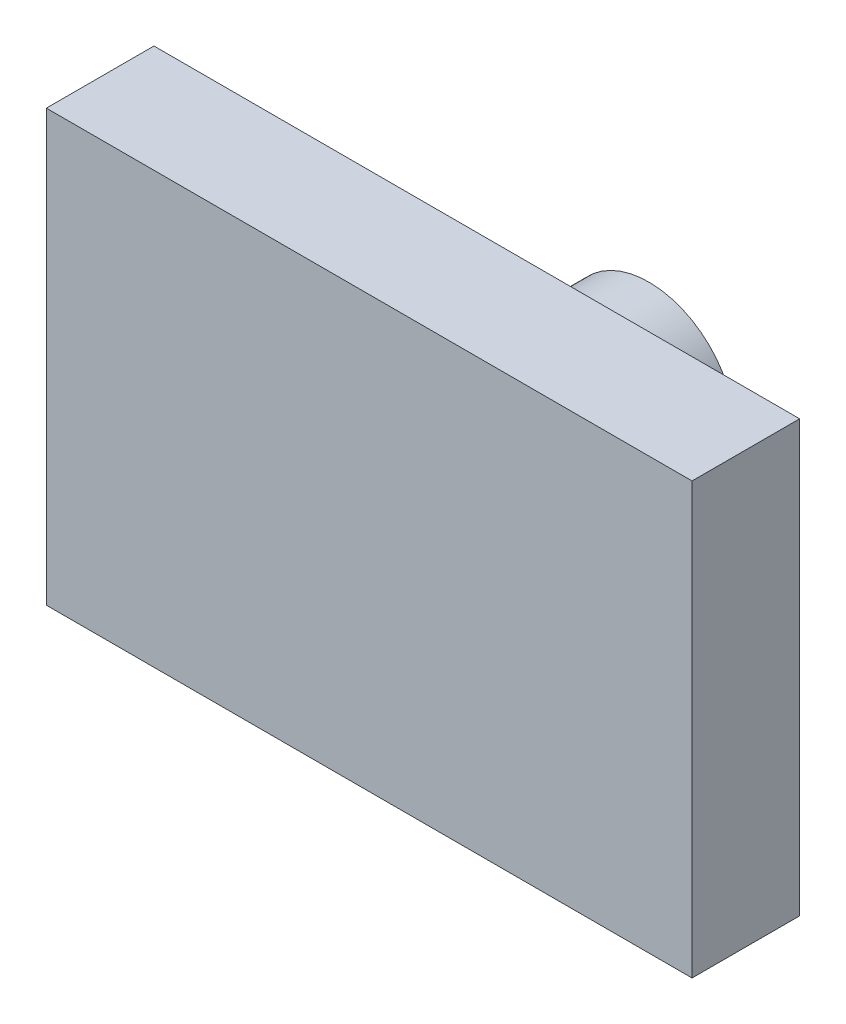
ISO-10303-21;
HEADER;
FILE_DESCRIPTION(('STEP AP214'),'2;1');
FILE_NAME('part.step','',(''),(''),'','','');
FILE_SCHEMA(('AUTOMOTIVE_DESIGN { 1 0 10303 214 1 1 1 1 }'));
ENDSEC;
DATA;
#1=APPLICATION_CONTEXT('core data for automotive mechanical design processes');
#2=APPLICATION_PROTOCOL_DEFINITION('international standard','automotive_design',2000,#1);
#3=PRODUCT_CONTEXT('',#1,'mechanical');
#4=PRODUCT('Part','Part','',(#3));
#5=PRODUCT_RELATED_PRODUCT_CATEGORY('part','',(#4));
#6=PRODUCT_DEFINITION_FORMATION('','',#4);
#7=PRODUCT_DEFINITION_CONTEXT('part definition',#1,'design');
#8=PRODUCT_DEFINITION('design','',#6,#7);
#9=PRODUCT_DEFINITION_SHAPE('','',#8);
#10=(LENGTH_UNIT() NAMED_UNIT(*) SI_UNIT(.MILLI.,.METRE.));
#11=(NAMED_UNIT(*) PLANE_ANGLE_UNIT() SI_UNIT($,.RADIAN.));
#12=(NAMED_UNIT(*) SI_UNIT($,.STERADIAN.) SOLID_ANGLE_UNIT());
#13=UNCERTAINTY_MEASURE_WITH_UNIT(LENGTH_MEASURE(1.E-05),#10,'distance_accuracy_value','');
#14=(GEOMETRIC_REPRESENTATION_CONTEXT(3) GLOBAL_UNCERTAINTY_ASSIGNED_CONTEXT((#13)) GLOBAL_UNIT_ASSIGNED_CONTEXT((#10,
#11,#12)) REPRESENTATION_CONTEXT('',''));
#15=CARTESIAN_POINT('',(0.,0.,0.));
#16=DIRECTION('',(0.,0.,1.));
#17=DIRECTION('',(1.,0.,0.));
#18=AXIS2_PLACEMENT_3D('',#15,#16,#17);
#19=CARTESIAN_POINT('',(-15.,10.,5.));
#20=DIRECTION('',(1.,0.,0.));
#21=DIRECTION('',(0.,0.,-1.));
#22=AXIS2_PLACEMENT_3D('',#19,#20,#21);
#23=PLANE('',#22);
#24=DIRECTION('',(0.,-1.,0.));
#25=VECTOR('',#24,1.);
#26=CARTESIAN_POINT('',(-15.,10.,0.));
#27=LINE('',#26,#25);
#28=CARTESIAN_POINT('',(-15.,10.,0.));
#29=VERTEX_POINT('',#28);
#30=CARTESIAN_POINT('',(-15.,-9.99999999999998,0.));
#31=VERTEX_POINT('',#30);
#32=EDGE_CURVE('E103',#29,#31,#27,.T.);
#33=ORIENTED_EDGE('',*,*,#32,.T.);
#34=DIRECTION('',(0.,0.,-1.));
#35=VECTOR('',#34,1.);
#36=CARTESIAN_POINT('',(-15.,-9.99999999999998,5.));
#37=LINE('',#36,#35);
#38=CARTESIAN_POINT('',(-15.,-9.99999999999998,5.));
#39=VERTEX_POINT('',#38);
#40=EDGE_CURVE('E40',#39,#31,#37,.T.);
#41=ORIENTED_EDGE('',*,*,#40,.F.);
#42=DIRECTION('',(0.,-1.,0.));
#43=VECTOR('',#42,1.);
#44=CARTESIAN_POINT('',(-15.,10.,5.));
#45=LINE('',#44,#43);
#46=CARTESIAN_POINT('',(-15.,10.,5.));
#47=VERTEX_POINT('',#46);
#48=EDGE_CURVE('E88',#47,#39,#45,.T.);
#49=ORIENTED_EDGE('',*,*,#48,.F.);
#50=DIRECTION('',(0.,0.,-1.));
#51=VECTOR('',#50,1.);
#52=CARTESIAN_POINT('',(-15.,10.,5.));
#53=LINE('',#52,#51);
#54=EDGE_CURVE('E54',#47,#29,#53,.T.);
#55=ORIENTED_EDGE('',*,*,#54,.T.);
#56=EDGE_LOOP('',(#33,#41,#49,#55));
#57=FACE_BOUND('',#56,.T.);
#58=ADVANCED_FACE('F37',(#57),#23,.F.);
#59=CARTESIAN_POINT('',(-15.,-9.99999999999998,5.));
#60=DIRECTION('',(0.,1.,0.));
#61=DIRECTION('',(0.,0.,1.));
#62=AXIS2_PLACEMENT_3D('',#59,#60,#61);
#63=PLANE('',#62);
#64=DIRECTION('',(1.,0.,0.));
#65=VECTOR('',#64,1.);
#66=CARTESIAN_POINT('',(-15.,-9.99999999999998,0.));
#67=LINE('',#66,#65);
#68=CARTESIAN_POINT('',(14.9999999999999,-9.99999999999998,0.));
#69=VERTEX_POINT('',#68);
#70=EDGE_CURVE('E94',#31,#69,#67,.T.);
#71=ORIENTED_EDGE('',*,*,#70,.T.);
#72=DIRECTION('',(0.,0.,-1.));
#73=VECTOR('',#72,1.);
#74=CARTESIAN_POINT('',(14.9999999999999,-9.99999999999998,5.));
#75=LINE('',#74,#73);
#76=CARTESIAN_POINT('',(14.9999999999999,-9.99999999999998,5.));
#77=VERTEX_POINT('',#76);
#78=EDGE_CURVE('E92',#77,#69,#75,.T.);
#79=ORIENTED_EDGE('',*,*,#78,.F.);
#80=DIRECTION('',(1.,0.,0.));
#81=VECTOR('',#80,1.);
#82=CARTESIAN_POINT('',(-15.,-9.99999999999998,5.));
#83=LINE('',#82,#81);
#84=EDGE_CURVE('E80',#39,#77,#83,.T.);
#85=ORIENTED_EDGE('',*,*,#84,.F.);
#86=ORIENTED_EDGE('',*,*,#40,.T.);
#87=EDGE_LOOP('',(#71,#79,#85,#86));
#88=FACE_BOUND('',#87,.T.);
#89=ADVANCED_FACE('F93',(#88),#63,.F.);
#90=CARTESIAN_POINT('',(15.,10.,5.));
#91=DIRECTION('',(1.,0.,0.));
#92=DIRECTION('',(0.,1.,0.));
#93=AXIS2_PLACEMENT_3D('',#90,#91,#92);
#94=PLANE('',#93);
#95=DIRECTION('',(0.,-1.,0.));
#96=VECTOR('',#95,1.);
#97=CARTESIAN_POINT('',(15.,10.,0.));
#98=LINE('',#97,#96);
#99=CARTESIAN_POINT('',(15.,10.,0.));
#100=VERTEX_POINT('',#99);
#101=EDGE_CURVE('E107',#100,#69,#98,.T.);
#102=ORIENTED_EDGE('',*,*,#101,.F.);
#103=DIRECTION('',(0.,0.,-1.));
#104=VECTOR('',#103,1.);
#105=CARTESIAN_POINT('',(15.,10.,5.));
#106=LINE('',#105,#104);
#107=CARTESIAN_POINT('',(15.,10.,5.));
#108=VERTEX_POINT('',#107);
#109=EDGE_CURVE('E68',#108,#100,#106,.T.);
#110=ORIENTED_EDGE('',*,*,#109,.F.);
#111=DIRECTION('',(0.,-1.,0.));
#112=VECTOR('',#111,1.);
#113=CARTESIAN_POINT('',(15.,10.,5.));
#114=LINE('',#113,#112);
#115=EDGE_CURVE('E87',#108,#77,#114,.T.);
#116=ORIENTED_EDGE('',*,*,#115,.T.);
#117=ORIENTED_EDGE('',*,*,#78,.T.);
#118=EDGE_LOOP('',(#102,#110,#116,#117));
#119=FACE_BOUND('',#118,.T.);
#120=ADVANCED_FACE('F97',(#119),#94,.T.);
#121=CARTESIAN_POINT('',(-15.,10.,5.));
#122=DIRECTION('',(0.,1.,0.));
#123=DIRECTION('',(0.,0.,1.));
#124=AXIS2_PLACEMENT_3D('',#121,#122,#123);
#125=PLANE('',#124);
#126=DIRECTION('',(1.,0.,0.));
#127=VECTOR('',#126,1.);
#128=CARTESIAN_POINT('',(-15.,10.,0.));
#129=LINE('',#128,#127);
#130=EDGE_CURVE('E109',#29,#100,#129,.T.);
#131=ORIENTED_EDGE('',*,*,#130,.F.);
#132=ORIENTED_EDGE('',*,*,#54,.F.);
#133=DIRECTION('',(1.,0.,0.));
#134=VECTOR('',#133,1.);
#135=CARTESIAN_POINT('',(-15.,10.,5.));
#136=LINE('',#135,#134);
#137=EDGE_CURVE('E98',#47,#108,#136,.T.);
#138=ORIENTED_EDGE('',*,*,#137,.T.);
#139=ORIENTED_EDGE('',*,*,#109,.T.);
#140=EDGE_LOOP('',(#131,#132,#138,#139));
#141=FACE_BOUND('',#140,.T.);
#142=ADVANCED_FACE('F147',(#141),#125,.T.);
#143=CARTESIAN_POINT('',(0.,0.,5.));
#144=DIRECTION('',(0.,0.,1.));
#145=DIRECTION('',(1.,0.,0.));
#146=AXIS2_PLACEMENT_3D('',#143,#144,#145);
#147=PLANE('',#146);
#148=ORIENTED_EDGE('',*,*,#48,.T.);
#149=ORIENTED_EDGE('',*,*,#84,.T.);
#150=ORIENTED_EDGE('',*,*,#115,.F.);
#151=ORIENTED_EDGE('',*,*,#137,.F.);
#152=EDGE_LOOP('',(#148,#149,#150,#151));
#153=FACE_BOUND('',#152,.T.);
#154=ADVANCED_FACE('F84',(#153),#147,.T.);
#155=CARTESIAN_POINT('',(0.,0.,0.));
#156=DIRECTION('',(0.,0.,1.));
#157=DIRECTION('',(1.,0.,0.));
#158=AXIS2_PLACEMENT_3D('',#155,#156,#157);
#159=PLANE('',#158);
#160=CARTESIAN_POINT('',(0.,0.,0.));
#161=DIRECTION('',(0.,0.,-1.));
#162=DIRECTION('',(-1.,0.,0.));
#163=AXIS2_PLACEMENT_3D('',#160,#161,#162);
#164=CIRCLE('',#163,4.);
#165=CARTESIAN_POINT('',(-4.,0.,0.));
#166=VERTEX_POINT('',#165);
#167=EDGE_CURVE('E11',#166,#166,#164,.T.);
#168=ORIENTED_EDGE('',*,*,#167,.F.);
#169=EDGE_LOOP('',(#168));
#170=FACE_BOUND('',#169,.T.);
#171=ORIENTED_EDGE('',*,*,#32,.F.);
#172=ORIENTED_EDGE('',*,*,#130,.T.);
#173=ORIENTED_EDGE('',*,*,#101,.T.);
#174=ORIENTED_EDGE('',*,*,#70,.F.);
#175=EDGE_LOOP('',(#171,#172,#173,#174));
#176=FACE_BOUND('',#175,.T.);
#177=ADVANCED_FACE('F141',(#170,#176),#159,.F.);
#178=CARTESIAN_POINT('',(0.,0.,-8.));
#179=DIRECTION('',(0.,0.,1.));
#180=DIRECTION('',(1.,0.,0.));
#181=AXIS2_PLACEMENT_3D('',#178,#179,#180);
#182=CYLINDRICAL_SURFACE('',#181,4.);
#183=CARTESIAN_POINT('',(0.,0.,-8.));
#184=DIRECTION('',(0.,0.,-1.));
#185=DIRECTION('',(-1.,0.,0.));
#186=AXIS2_PLACEMENT_3D('',#183,#184,#185);
#187=CIRCLE('',#186,4.);
#188=CARTESIAN_POINT('',(-4.,0.,-8.));
#189=VERTEX_POINT('',#188);
#190=EDGE_CURVE('E105',#189,#189,#187,.T.);
#191=ORIENTED_EDGE('',*,*,#190,.F.);
#192=EDGE_LOOP('',(#191));
#193=FACE_BOUND('',#192,.T.);
#194=ORIENTED_EDGE('',*,*,#167,.T.);
#195=EDGE_LOOP('',(#194));
#196=FACE_BOUND('',#195,.T.);
#197=ADVANCED_FACE('F135',(#193,#196),#182,.T.);
#198=CARTESIAN_POINT('',(0.,0.,-8.));
#199=DIRECTION('',(0.,0.,-1.));
#200=DIRECTION('',(-1.,0.,0.));
#201=AXIS2_PLACEMENT_3D('',#198,#199,#200);
#202=PLANE('',#201);
#203=CARTESIAN_POINT('',(0.,0.,-8.));
#204=DIRECTION('',(0.,0.,-1.));
#205=DIRECTION('',(-1.,0.,0.));
#206=AXIS2_PLACEMENT_3D('',#203,#204,#205);
#207=CIRCLE('',#206,2.1);
#208=CARTESIAN_POINT('',(-2.1,0.,-8.));
#209=VERTEX_POINT('',#208);
#210=EDGE_CURVE('E118',#209,#209,#207,.T.);
#211=ORIENTED_EDGE('',*,*,#210,.F.);
#212=EDGE_LOOP('',(#211));
#213=FACE_BOUND('',#212,.T.);
#214=ORIENTED_EDGE('',*,*,#190,.T.);
#215=EDGE_LOOP('',(#214));
#216=FACE_BOUND('',#215,.T.);
#217=ADVANCED_FACE('F129',(#213,#216),#202,.T.);
#218=CARTESIAN_POINT('',(0.,0.,-1.5));
#219=DIRECTION('',(0.,0.,-1.));
#220=DIRECTION('',(-1.,0.,0.));
#221=AXIS2_PLACEMENT_3D('',#218,#219,#220);
#222=CYLINDRICAL_SURFACE('',#221,2.1);
#223=CARTESIAN_POINT('',(0.,0.,-1.5));
#224=DIRECTION('',(0.,0.,-1.));
#225=DIRECTION('',(-1.,0.,0.));
#226=AXIS2_PLACEMENT_3D('',#223,#224,#225);
#227=CIRCLE('',#226,2.1);
#228=CARTESIAN_POINT('',(-2.1,0.,-1.5));
#229=VERTEX_POINT('',#228);
#230=EDGE_CURVE('E117',#229,#229,#227,.T.);
#231=ORIENTED_EDGE('',*,*,#230,.F.);
#232=EDGE_LOOP('',(#231));
#233=FACE_BOUND('',#232,.T.);
#234=ORIENTED_EDGE('',*,*,#210,.T.);
#235=EDGE_LOOP('',(#234));
#236=FACE_BOUND('',#235,.T.);
#237=ADVANCED_FACE('F126',(#233,#236),#222,.F.);
#238=CARTESIAN_POINT('',(0.,0.,-1.5));
#239=DIRECTION('',(0.,0.,-1.));
#240=DIRECTION('',(-1.,0.,0.));
#241=AXIS2_PLACEMENT_3D('',#238,#239,#240);
#242=PLANE('',#241);
#243=ORIENTED_EDGE('',*,*,#230,.T.);
#244=EDGE_LOOP('',(#243));
#245=FACE_BOUND('',#244,.T.);
#246=ADVANCED_FACE('F124',(#245),#242,.T.);
#247=CLOSED_SHELL('',(#58,#89,#120,#142,#154,#177,#197,#217,#237,#246));
#248=MANIFOLD_SOLID_BREP('B2',#247);
#249=ADVANCED_BREP_SHAPE_REPRESENTATION('',(#18,#248),#14);
#250=SHAPE_DEFINITION_REPRESENTATION(#9,#249);
ENDSEC;
END-ISO-10303-21;
